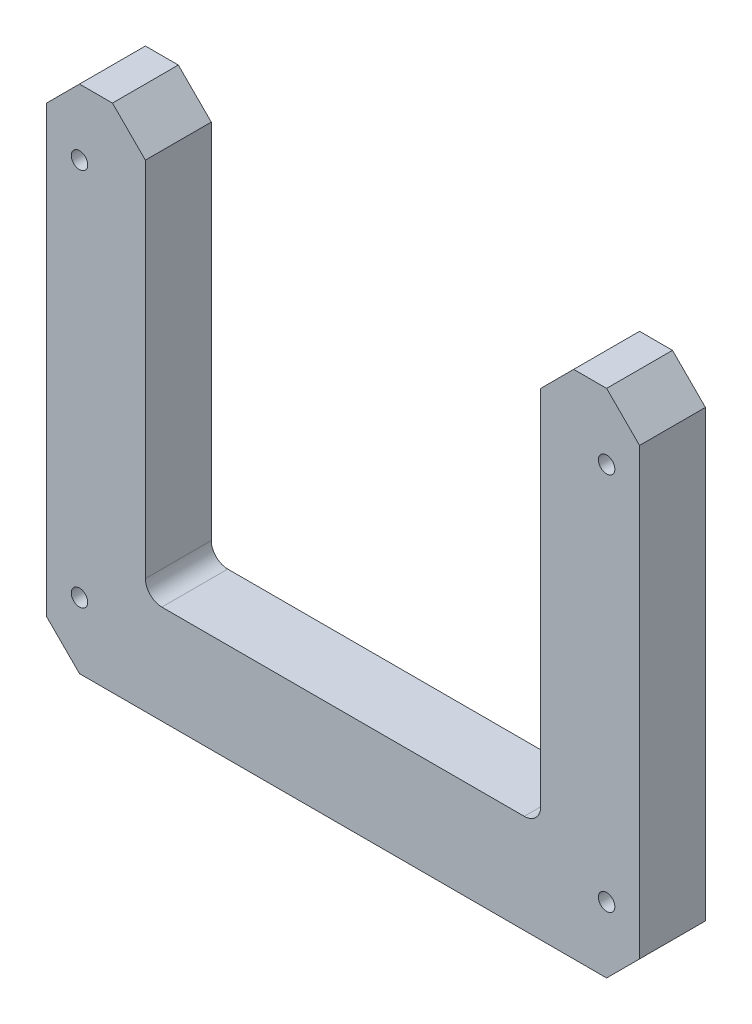
ISO-10303-21;
HEADER;
FILE_DESCRIPTION(('STEP AP214'),'2;1');
FILE_NAME('part.step','',(''),(''),'','','');
FILE_SCHEMA(('AUTOMOTIVE_DESIGN { 1 0 10303 214 1 1 1 1 }'));
ENDSEC;
DATA;
#1=APPLICATION_CONTEXT('core data for automotive mechanical design processes');
#2=APPLICATION_PROTOCOL_DEFINITION('international standard','automotive_design',2000,#1);
#3=PRODUCT_CONTEXT('',#1,'mechanical');
#4=PRODUCT('Part','Part','',(#3));
#5=PRODUCT_RELATED_PRODUCT_CATEGORY('part','',(#4));
#6=PRODUCT_DEFINITION_FORMATION('','',#4);
#7=PRODUCT_DEFINITION_CONTEXT('part definition',#1,'design');
#8=PRODUCT_DEFINITION('design','',#6,#7);
#9=PRODUCT_DEFINITION_SHAPE('','',#8);
#10=(LENGTH_UNIT() NAMED_UNIT(*) SI_UNIT(.MILLI.,.METRE.));
#11=(NAMED_UNIT(*) PLANE_ANGLE_UNIT() SI_UNIT($,.RADIAN.));
#12=(NAMED_UNIT(*) SI_UNIT($,.STERADIAN.) SOLID_ANGLE_UNIT());
#13=UNCERTAINTY_MEASURE_WITH_UNIT(LENGTH_MEASURE(1.E-05),#10,'distance_accuracy_value','');
#14=(GEOMETRIC_REPRESENTATION_CONTEXT(3) GLOBAL_UNCERTAINTY_ASSIGNED_CONTEXT((#13)) GLOBAL_UNIT_ASSIGNED_CONTEXT((#10,
#11,#12)) REPRESENTATION_CONTEXT('',''));
#15=CARTESIAN_POINT('',(0.,0.,0.));
#16=DIRECTION('',(0.,0.,1.));
#17=DIRECTION('',(1.,0.,0.));
#18=AXIS2_PLACEMENT_3D('',#15,#16,#17);
#19=CARTESIAN_POINT('',(-250.077465963196,69.0432096796373,12.7));
#20=DIRECTION('',(0.,-1.00000000000001,0.));
#21=DIRECTION('',(0.,0.,-1.00000000000001));
#22=AXIS2_PLACEMENT_3D('',#19,#20,#21);
#23=PLANE('',#22);
#24=DIRECTION('',(-1.,0.,0.));
#25=VECTOR('',#24,1.);
#26=CARTESIAN_POINT('',(-250.077465963196,69.043209679636,1.11022302462516E-13));
#27=LINE('',#26,#25);
#28=CARTESIAN_POINT('',(-237.377465963196,69.043209679636,0.));
#29=VERTEX_POINT('',#28);
#30=CARTESIAN_POINT('',(-243.727465963196,69.0432096796368,2.22044604925031E-13));
#31=VERTEX_POINT('',#30);
#32=EDGE_CURVE('E279',#29,#31,#27,.T.);
#33=ORIENTED_EDGE('',*,*,#32,.T.);
#34=DIRECTION('',(0.,0.,1.00000000000001));
#35=VECTOR('',#34,1.);
#36=CARTESIAN_POINT('',(-243.727465963196,69.0432096796373,12.7000000000001));
#37=LINE('',#36,#35);
#38=CARTESIAN_POINT('',(-243.727465963196,69.0432096796373,12.7000000000001));
#39=VERTEX_POINT('',#38);
#40=EDGE_CURVE('E51',#31,#39,#37,.T.);
#41=ORIENTED_EDGE('',*,*,#40,.T.);
#42=DIRECTION('',(-1.,0.,0.));
#43=VECTOR('',#42,1.);
#44=CARTESIAN_POINT('',(-250.077465963196,69.0432096796373,12.7));
#45=LINE('',#44,#43);
#46=CARTESIAN_POINT('',(-237.377465963196,69.0432096796372,12.7));
#47=VERTEX_POINT('',#46);
#48=EDGE_CURVE('E189',#47,#39,#45,.T.);
#49=ORIENTED_EDGE('',*,*,#48,.F.);
#50=DIRECTION('',(0.,0.,-1.00000000000001));
#51=VECTOR('',#50,1.);
#52=CARTESIAN_POINT('',(-237.377465963196,69.0432096796372,12.7));
#53=LINE('',#52,#51);
#54=EDGE_CURVE('E250',#47,#29,#53,.T.);
#55=ORIENTED_EDGE('',*,*,#54,.T.);
#56=EDGE_LOOP('',(#33,#41,#49,#55));
#57=FACE_BOUND('',#56,.T.);
#58=ADVANCED_FACE('F42',(#57),#23,.F.);
#59=CARTESIAN_POINT('',(-250.077465963196,69.0432096796373,12.7));
#60=DIRECTION('',(1.,0.,0.));
#61=DIRECTION('',(0.,0.,-1.00000000000001));
#62=AXIS2_PLACEMENT_3D('',#59,#60,#61);
#63=PLANE('',#62);
#64=DIRECTION('',(0.,-1.00000000000001,0.));
#65=VECTOR('',#64,1.);
#66=CARTESIAN_POINT('',(-250.077465963196,69.043209679636,1.11022302462516E-13));
#67=LINE('',#66,#65);
#68=CARTESIAN_POINT('',(-250.077465963196,62.6932096796363,0.));
#69=VERTEX_POINT('',#68);
#70=CARTESIAN_POINT('',(-250.077465963196,-23.031790320364,1.11022302462516E-13));
#71=VERTEX_POINT('',#70);
#72=EDGE_CURVE('E299',#69,#71,#67,.T.);
#73=ORIENTED_EDGE('',*,*,#72,.T.);
#74=DIRECTION('',(0.,0.,1.00000000000001));
#75=VECTOR('',#74,1.);
#76=CARTESIAN_POINT('',(-250.077465963196,-23.0317903203641,12.7000000000001));
#77=LINE('',#76,#75);
#78=CARTESIAN_POINT('',(-250.077465963196,-23.0317903203641,12.7000000000001));
#79=VERTEX_POINT('',#78);
#80=EDGE_CURVE('E224',#71,#79,#77,.T.);
#81=ORIENTED_EDGE('',*,*,#80,.T.);
#82=DIRECTION('',(0.,-1.00000000000001,0.));
#83=VECTOR('',#82,1.);
#84=CARTESIAN_POINT('',(-250.077465963196,69.0432096796373,12.7));
#85=LINE('',#84,#83);
#86=CARTESIAN_POINT('',(-250.077465963196,62.693209679637,12.7000000000003));
#87=VERTEX_POINT('',#86);
#88=EDGE_CURVE('E282',#87,#79,#85,.T.);
#89=ORIENTED_EDGE('',*,*,#88,.F.);
#90=DIRECTION('',(0.,0.,-1.00000000000001));
#91=VECTOR('',#90,1.);
#92=CARTESIAN_POINT('',(-250.077465963196,62.693209679637,12.7000000000003));
#93=LINE('',#92,#91);
#94=EDGE_CURVE('E221',#87,#69,#93,.T.);
#95=ORIENTED_EDGE('',*,*,#94,.T.);
#96=EDGE_LOOP('',(#73,#81,#89,#95));
#97=FACE_BOUND('',#96,.T.);
#98=ADVANCED_FACE('F339',(#97),#63,.F.);
#99=CARTESIAN_POINT('',(-250.077465963195,-29.381790320364,12.7));
#100=DIRECTION('',(0.,1.00000000000001,0.));
#101=DIRECTION('',(-1.,0.,0.));
#102=AXIS2_PLACEMENT_3D('',#99,#100,#101);
#103=PLANE('',#102);
#104=DIRECTION('',(1.,0.,0.));
#105=VECTOR('',#104,1.);
#106=CARTESIAN_POINT('',(-250.077465963195,-29.381790320364,12.7));
#107=LINE('',#106,#105);
#108=CARTESIAN_POINT('',(-243.727465963196,-29.381790320364,12.7000000000001));
#109=VERTEX_POINT('',#108);
#110=CARTESIAN_POINT('',(-142.127465963196,-29.3817903203637,12.7));
#111=VERTEX_POINT('',#110);
#112=EDGE_CURVE('E285',#109,#111,#107,.T.);
#113=ORIENTED_EDGE('',*,*,#112,.F.);
#114=DIRECTION('',(0.,0.,-1.00000000000001));
#115=VECTOR('',#114,1.);
#116=CARTESIAN_POINT('',(-243.727465963196,-29.381790320364,12.7000000000001));
#117=LINE('',#116,#115);
#118=CARTESIAN_POINT('',(-243.727465963196,-29.3817903203636,1.11022302462516E-13));
#119=VERTEX_POINT('',#118);
#120=EDGE_CURVE('E206',#109,#119,#117,.T.);
#121=ORIENTED_EDGE('',*,*,#120,.T.);
#122=DIRECTION('',(1.,0.,0.));
#123=VECTOR('',#122,1.);
#124=CARTESIAN_POINT('',(-250.077465963196,-29.3817903203637,1.11022302462516E-13));
#125=LINE('',#124,#123);
#126=CARTESIAN_POINT('',(-142.127465963196,-29.3817903203638,0.));
#127=VERTEX_POINT('',#126);
#128=EDGE_CURVE('E302',#119,#127,#125,.T.);
#129=ORIENTED_EDGE('',*,*,#128,.T.);
#130=DIRECTION('',(0.,0.,1.00000000000001));
#131=VECTOR('',#130,1.);
#132=CARTESIAN_POINT('',(-142.127465963196,-29.3817903203637,12.7));
#133=LINE('',#132,#131);
#134=EDGE_CURVE('E204',#127,#111,#133,.T.);
#135=ORIENTED_EDGE('',*,*,#134,.T.);
#136=EDGE_LOOP('',(#113,#121,#129,#135));
#137=FACE_BOUND('',#136,.T.);
#138=ADVANCED_FACE('F347',(#137),#103,.F.);
#139=CARTESIAN_POINT('',(-135.777465963196,69.0432096796371,12.7));
#140=DIRECTION('',(-1.,0.,0.));
#141=DIRECTION('',(0.,0.,1.00000000000001));
#142=AXIS2_PLACEMENT_3D('',#139,#140,#141);
#143=PLANE('',#142);
#144=DIRECTION('',(0.,1.00000000000001,0.));
#145=VECTOR('',#144,1.);
#146=CARTESIAN_POINT('',(-135.777465963196,69.0432096796371,12.7));
#147=LINE('',#146,#145);
#148=CARTESIAN_POINT('',(-135.777465963196,-23.031790320364,12.7000000000002));
#149=VERTEX_POINT('',#148);
#150=CARTESIAN_POINT('',(-135.777465963196,62.6932096796371,12.7));
#151=VERTEX_POINT('',#150);
#152=EDGE_CURVE('E288',#149,#151,#147,.T.);
#153=ORIENTED_EDGE('',*,*,#152,.F.);
#154=DIRECTION('',(0.,0.,-1.00000000000001));
#155=VECTOR('',#154,1.);
#156=CARTESIAN_POINT('',(-135.777465963196,-23.031790320364,12.7000000000002));
#157=LINE('',#156,#155);
#158=CARTESIAN_POINT('',(-135.777465963196,-23.0317903203639,0.));
#159=VERTEX_POINT('',#158);
#160=EDGE_CURVE('E239',#149,#159,#157,.T.);
#161=ORIENTED_EDGE('',*,*,#160,.T.);
#162=DIRECTION('',(0.,1.00000000000001,0.));
#163=VECTOR('',#162,1.);
#164=CARTESIAN_POINT('',(-135.777465963196,69.0432096796361,0.));
#165=LINE('',#164,#163);
#166=CARTESIAN_POINT('',(-135.777465963196,62.693209679636,1.11022302462516E-13));
#167=VERTEX_POINT('',#166);
#168=EDGE_CURVE('E305',#159,#167,#165,.T.);
#169=ORIENTED_EDGE('',*,*,#168,.T.);
#170=DIRECTION('',(0.,0.,1.00000000000001));
#171=VECTOR('',#170,1.);
#172=CARTESIAN_POINT('',(-135.777465963196,62.6932096796371,12.7));
#173=LINE('',#172,#171);
#174=EDGE_CURVE('E237',#167,#151,#173,.T.);
#175=ORIENTED_EDGE('',*,*,#174,.T.);
#176=EDGE_LOOP('',(#153,#161,#169,#175));
#177=FACE_BOUND('',#176,.T.);
#178=ADVANCED_FACE('F356',(#177),#143,.F.);
#179=CARTESIAN_POINT('',(-154.827465963196,69.0432096796377,12.7000000000003));
#180=DIRECTION('',(0.,-1.00000000000001,0.));
#181=DIRECTION('',(0.,0.,-1.00000000000001));
#182=AXIS2_PLACEMENT_3D('',#179,#180,#181);
#183=PLANE('',#182);
#184=DIRECTION('',(-1.,0.,0.));
#185=VECTOR('',#184,1.);
#186=CARTESIAN_POINT('',(-154.827465963196,69.0432096796377,12.7000000000003));
#187=LINE('',#186,#185);
#188=CARTESIAN_POINT('',(-142.127465963196,69.0432096796372,12.7));
#189=VERTEX_POINT('',#188);
#190=CARTESIAN_POINT('',(-148.477465963196,69.0432096796377,12.7000000000005));
#191=VERTEX_POINT('',#190);
#192=EDGE_CURVE('E291',#189,#191,#187,.T.);
#193=ORIENTED_EDGE('',*,*,#192,.F.);
#194=DIRECTION('',(0.,0.,-1.00000000000001));
#195=VECTOR('',#194,1.);
#196=CARTESIAN_POINT('',(-142.127465963196,69.0432096796372,12.7));
#197=LINE('',#196,#195);
#198=CARTESIAN_POINT('',(-142.127465963196,69.0432096796361,0.));
#199=VERTEX_POINT('',#198);
#200=EDGE_CURVE('E244',#189,#199,#197,.T.);
#201=ORIENTED_EDGE('',*,*,#200,.T.);
#202=DIRECTION('',(-1.,0.,0.));
#203=VECTOR('',#202,1.);
#204=CARTESIAN_POINT('',(-154.827465963196,69.043209679636,0.));
#205=LINE('',#204,#203);
#206=CARTESIAN_POINT('',(-148.477465963196,69.0432096796366,7.7715611723761E-13));
#207=VERTEX_POINT('',#206);
#208=EDGE_CURVE('E191',#199,#207,#205,.T.);
#209=ORIENTED_EDGE('',*,*,#208,.T.);
#210=DIRECTION('',(0.,0.,1.00000000000001));
#211=VECTOR('',#210,1.);
#212=CARTESIAN_POINT('',(-148.477465963196,69.0432096796377,12.7000000000005));
#213=LINE('',#212,#211);
#214=EDGE_CURVE('E242',#207,#191,#213,.T.);
#215=ORIENTED_EDGE('',*,*,#214,.T.);
#216=EDGE_LOOP('',(#193,#201,#209,#215));
#217=FACE_BOUND('',#216,.T.);
#218=ADVANCED_FACE('F312',(#217),#183,.F.);
#219=CARTESIAN_POINT('',(-154.827465963196,69.0432096796377,12.7000000000003));
#220=DIRECTION('',(1.,0.,0.));
#221=DIRECTION('',(0.,0.,-1.00000000000001));
#222=AXIS2_PLACEMENT_3D('',#219,#220,#221);
#223=PLANE('',#222);
#224=DIRECTION('',(0.,-1.00000000000001,0.));
#225=VECTOR('',#224,1.);
#226=CARTESIAN_POINT('',(-154.827465963196,69.0432096796377,12.7000000000003));
#227=LINE('',#226,#225);
#228=CARTESIAN_POINT('',(-154.827465963196,62.6932096796371,12.7000000000002));
#229=VERTEX_POINT('',#228);
#230=CARTESIAN_POINT('',(-154.827465963196,-7.15679032036326,12.7000000000008));
#231=VERTEX_POINT('',#230);
#232=EDGE_CURVE('E293',#229,#231,#227,.T.);
#233=ORIENTED_EDGE('',*,*,#232,.F.);
#234=DIRECTION('',(0.,0.,-1.00000000000001));
#235=VECTOR('',#234,1.);
#236=CARTESIAN_POINT('',(-154.827465963196,62.6932096796371,12.7000000000002));
#237=LINE('',#236,#235);
#238=CARTESIAN_POINT('',(-154.827465963196,62.693209679637,4.9960036108132E-13));
#239=VERTEX_POINT('',#238);
#240=EDGE_CURVE('E247',#229,#239,#237,.T.);
#241=ORIENTED_EDGE('',*,*,#240,.T.);
#242=DIRECTION('',(0.,-1.00000000000001,0.));
#243=VECTOR('',#242,1.);
#244=CARTESIAN_POINT('',(-154.827465963196,69.043209679636,0.));
#245=LINE('',#244,#243);
#246=CARTESIAN_POINT('',(-154.827465963196,-7.15679032036395,1.11022302462516E-13));
#247=VERTEX_POINT('',#246);
#248=EDGE_CURVE('E187',#239,#247,#245,.T.);
#249=ORIENTED_EDGE('',*,*,#248,.T.);
#250=DIRECTION('',(0.,0.,-1.00000000000001));
#251=VECTOR('',#250,1.);
#252=CARTESIAN_POINT('',(-154.827465963196,-7.15679032036326,12.7000000000008));
#253=LINE('',#252,#251);
#254=EDGE_CURVE('E165',#247,#231,#253,.F.);
#255=ORIENTED_EDGE('',*,*,#254,.T.);
#256=EDGE_LOOP('',(#233,#241,#249,#255));
#257=FACE_BOUND('',#256,.T.);
#258=ADVANCED_FACE('F318',(#257),#223,.F.);
#259=CARTESIAN_POINT('',(-231.027465963196,-10.331790320363,12.7000000000007));
#260=DIRECTION('',(0.,-1.00000000000001,0.));
#261=DIRECTION('',(1.,0.,0.));
#262=AXIS2_PLACEMENT_3D('',#259,#260,#261);
#263=PLANE('',#262);
#264=DIRECTION('',(-1.,0.,0.));
#265=VECTOR('',#264,1.);
#266=CARTESIAN_POINT('',(-231.027465963196,-10.331790320363,12.7000000000007));
#267=LINE('',#266,#265);
#268=CARTESIAN_POINT('',(-158.002465963196,-10.3317903203632,12.7000000000005));
#269=VERTEX_POINT('',#268);
#270=CARTESIAN_POINT('',(-227.852465963196,-10.3317903203636,12.7000000000002));
#271=VERTEX_POINT('',#270);
#272=EDGE_CURVE('E179',#269,#271,#267,.T.);
#273=ORIENTED_EDGE('',*,*,#272,.F.);
#274=DIRECTION('',(0.,0.,-1.00000000000001));
#275=VECTOR('',#274,1.);
#276=CARTESIAN_POINT('',(-158.002465963196,-10.3317903203639,0.));
#277=LINE('',#276,#275);
#278=CARTESIAN_POINT('',(-158.002465963196,-10.3317903203639,0.));
#279=VERTEX_POINT('',#278);
#280=EDGE_CURVE('E163',#269,#279,#277,.T.);
#281=ORIENTED_EDGE('',*,*,#280,.T.);
#282=DIRECTION('',(-1.,0.,0.));
#283=VECTOR('',#282,1.);
#284=CARTESIAN_POINT('',(-231.027465963196,-10.331790320364,1.11022302462516E-13));
#285=LINE('',#284,#283);
#286=CARTESIAN_POINT('',(-227.852465963196,-10.3317903203639,0.));
#287=VERTEX_POINT('',#286);
#288=EDGE_CURVE('E176',#279,#287,#285,.T.);
#289=ORIENTED_EDGE('',*,*,#288,.T.);
#290=DIRECTION('',(0.,0.,-1.00000000000001));
#291=VECTOR('',#290,1.);
#292=CARTESIAN_POINT('',(-227.852465963196,-10.3317903203636,12.7000000000002));
#293=LINE('',#292,#291);
#294=EDGE_CURVE('E180',#287,#271,#293,.F.);
#295=ORIENTED_EDGE('',*,*,#294,.T.);
#296=EDGE_LOOP('',(#273,#281,#289,#295));
#297=FACE_BOUND('',#296,.T.);
#298=ADVANCED_FACE('F175',(#297),#263,.F.);
#299=CARTESIAN_POINT('',(-231.027465963196,69.043209679637,12.7000000000002));
#300=DIRECTION('',(-1.,0.,0.));
#301=DIRECTION('',(0.,0.,1.00000000000001));
#302=AXIS2_PLACEMENT_3D('',#299,#300,#301);
#303=PLANE('',#302);
#304=DIRECTION('',(0.,1.00000000000001,0.));
#305=VECTOR('',#304,1.);
#306=CARTESIAN_POINT('',(-231.027465963196,69.0432096796361,2.22044604925031E-13));
#307=LINE('',#306,#305);
#308=CARTESIAN_POINT('',(-231.027465963196,-7.15679032036401,0.));
#309=VERTEX_POINT('',#308);
#310=CARTESIAN_POINT('',(-231.027465963196,62.6932096796361,1.11022302462516E-13));
#311=VERTEX_POINT('',#310);
#312=EDGE_CURVE('E186',#309,#311,#307,.T.);
#313=ORIENTED_EDGE('',*,*,#312,.T.);
#314=DIRECTION('',(0.,0.,1.00000000000001));
#315=VECTOR('',#314,1.);
#316=CARTESIAN_POINT('',(-231.027465963196,62.6932096796371,12.7000000000002));
#317=LINE('',#316,#315);
#318=CARTESIAN_POINT('',(-231.027465963196,62.6932096796371,12.7000000000002));
#319=VERTEX_POINT('',#318);
#320=EDGE_CURVE('E11',#311,#319,#317,.T.);
#321=ORIENTED_EDGE('',*,*,#320,.T.);
#322=DIRECTION('',(0.,1.00000000000001,0.));
#323=VECTOR('',#322,1.);
#324=CARTESIAN_POINT('',(-231.027465963196,69.043209679637,12.7000000000002));
#325=LINE('',#324,#323);
#326=CARTESIAN_POINT('',(-231.027465963196,-7.15679032036345,12.7000000000003));
#327=VERTEX_POINT('',#326);
#328=EDGE_CURVE('E195',#327,#319,#325,.T.);
#329=ORIENTED_EDGE('',*,*,#328,.F.);
#330=DIRECTION('',(0.,0.,-1.00000000000001));
#331=VECTOR('',#330,1.);
#332=CARTESIAN_POINT('',(-231.027465963196,-7.15679032036401,0.));
#333=LINE('',#332,#331);
#334=EDGE_CURVE('E170',#327,#309,#333,.T.);
#335=ORIENTED_EDGE('',*,*,#334,.T.);
#336=EDGE_LOOP('',(#313,#321,#329,#335));
#337=FACE_BOUND('',#336,.T.);
#338=ADVANCED_FACE('F324',(#337),#303,.F.);
#339=CARTESIAN_POINT('',(0.,6.10622663543836E-13,12.7000000000004));
#340=DIRECTION('',(0.,0.,-1.00000000000001));
#341=DIRECTION('',(-1.,0.,0.));
#342=AXIS2_PLACEMENT_3D('',#339,#340,#341);
#343=PLANE('',#342);
#344=CARTESIAN_POINT('',(-243.727465963196,-16.6817903203637,12.7));
#345=DIRECTION('',(0.,0.,-1.00000000000001));
#346=DIRECTION('',(-1.,0.,0.));
#347=AXIS2_PLACEMENT_3D('',#344,#345,#346);
#348=CIRCLE('',#347,1.58749999999999);
#349=CARTESIAN_POINT('',(-245.314965963196,-16.6817903203637,12.7));
#350=VERTEX_POINT('',#349);
#351=EDGE_CURVE('E264',#350,#350,#348,.T.);
#352=ORIENTED_EDGE('',*,*,#351,.T.);
#353=EDGE_LOOP('',(#352));
#354=FACE_BOUND('',#353,.T.);
#355=CARTESIAN_POINT('',(-243.727465963196,56.3432096796373,12.7000000000001));
#356=DIRECTION('',(0.,0.,-1.00000000000001));
#357=DIRECTION('',(-1.,0.,0.));
#358=AXIS2_PLACEMENT_3D('',#355,#356,#357);
#359=CIRCLE('',#358,1.58749999999999);
#360=CARTESIAN_POINT('',(-245.314965963196,56.3432096796373,12.7000000000001));
#361=VERTEX_POINT('',#360);
#362=EDGE_CURVE('E261',#361,#361,#359,.T.);
#363=ORIENTED_EDGE('',*,*,#362,.T.);
#364=EDGE_LOOP('',(#363));
#365=FACE_BOUND('',#364,.T.);
#366=CARTESIAN_POINT('',(-142.127465963196,-16.6817903203637,12.7));
#367=DIRECTION('',(0.,0.,-1.00000000000001));
#368=DIRECTION('',(-1.,0.,0.));
#369=AXIS2_PLACEMENT_3D('',#366,#367,#368);
#370=CIRCLE('',#369,1.58749999999999);
#371=CARTESIAN_POINT('',(-143.714965963196,-16.6817903203637,12.7));
#372=VERTEX_POINT('',#371);
#373=EDGE_CURVE('E258',#372,#372,#370,.T.);
#374=ORIENTED_EDGE('',*,*,#373,.T.);
#375=EDGE_LOOP('',(#374));
#376=FACE_BOUND('',#375,.T.);
#377=CARTESIAN_POINT('',(-142.127465963196,56.3432096796373,12.7));
#378=DIRECTION('',(0.,0.,-1.00000000000001));
#379=DIRECTION('',(-1.,0.,0.));
#380=AXIS2_PLACEMENT_3D('',#377,#378,#379);
#381=CIRCLE('',#380,1.58749999999999);
#382=CARTESIAN_POINT('',(-143.714965963196,56.3432096796373,12.7));
#383=VERTEX_POINT('',#382);
#384=EDGE_CURVE('E257',#383,#383,#381,.T.);
#385=ORIENTED_EDGE('',*,*,#384,.T.);
#386=EDGE_LOOP('',(#385));
#387=FACE_BOUND('',#386,.T.);
#388=ORIENTED_EDGE('',*,*,#88,.T.);
#389=DIRECTION('',(-0.707106781186549,0.707106781186551,0.));
#390=VECTOR('',#389,1.);
#391=CARTESIAN_POINT('',(-243.727465963196,-29.381790320364,12.7000000000001));
#392=LINE('',#391,#390);
#393=EDGE_CURVE('E235',#79,#109,#392,.F.);
#394=ORIENTED_EDGE('',*,*,#393,.T.);
#395=ORIENTED_EDGE('',*,*,#112,.T.);
#396=DIRECTION('',(-0.707106781186548,-0.707106781186557,0.));
#397=VECTOR('',#396,1.);
#398=CARTESIAN_POINT('',(-135.777465963196,-23.031790320364,12.7000000000002));
#399=LINE('',#398,#397);
#400=EDGE_CURVE('E233',#111,#149,#399,.F.);
#401=ORIENTED_EDGE('',*,*,#400,.T.);
#402=ORIENTED_EDGE('',*,*,#152,.T.);
#403=DIRECTION('',(0.707106781186544,-0.707106781186556,0.));
#404=VECTOR('',#403,1.);
#405=CARTESIAN_POINT('',(-142.127465963196,69.0432096796372,12.7));
#406=LINE('',#405,#404);
#407=EDGE_CURVE('E231',#151,#189,#406,.F.);
#408=ORIENTED_EDGE('',*,*,#407,.T.);
#409=ORIENTED_EDGE('',*,*,#192,.T.);
#410=DIRECTION('',(0.707106781186551,0.707106781186554,0.));
#411=VECTOR('',#410,1.);
#412=CARTESIAN_POINT('',(-154.827465963196,62.6932096796371,12.7000000000002));
#413=LINE('',#412,#411);
#414=EDGE_CURVE('E65',#191,#229,#413,.F.);
#415=ORIENTED_EDGE('',*,*,#414,.T.);
#416=ORIENTED_EDGE('',*,*,#232,.T.);
#417=CARTESIAN_POINT('',(-158.002465963196,-7.15679032036323,12.7000000000007));
#418=DIRECTION('',(0.,0.,-1.00000000000001));
#419=DIRECTION('',(-1.,0.,0.));
#420=AXIS2_PLACEMENT_3D('',#417,#418,#419);
#421=CIRCLE('',#420,3.175);
#422=EDGE_CURVE('E169',#231,#269,#421,.T.);
#423=ORIENTED_EDGE('',*,*,#422,.T.);
#424=ORIENTED_EDGE('',*,*,#272,.T.);
#425=CARTESIAN_POINT('',(-227.852465963196,-7.1567903203632,12.7000000000008));
#426=DIRECTION('',(0.,0.,-1.00000000000001));
#427=DIRECTION('',(-1.,0.,0.));
#428=AXIS2_PLACEMENT_3D('',#425,#426,#427);
#429=CIRCLE('',#428,3.175);
#430=EDGE_CURVE('E202',#271,#327,#429,.T.);
#431=ORIENTED_EDGE('',*,*,#430,.T.);
#432=ORIENTED_EDGE('',*,*,#328,.T.);
#433=DIRECTION('',(0.707106781186546,-0.707106781186554,0.));
#434=VECTOR('',#433,1.);
#435=CARTESIAN_POINT('',(-237.377465963196,69.0432096796372,12.7));
#436=LINE('',#435,#434);
#437=EDGE_CURVE('E226',#319,#47,#436,.F.);
#438=ORIENTED_EDGE('',*,*,#437,.T.);
#439=ORIENTED_EDGE('',*,*,#48,.T.);
#440=DIRECTION('',(0.70710678118655,0.707106781186555,0.));
#441=VECTOR('',#440,1.);
#442=CARTESIAN_POINT('',(-250.077465963196,62.693209679637,12.7000000000003));
#443=LINE('',#442,#441);
#444=EDGE_CURVE('E228',#39,#87,#443,.F.);
#445=ORIENTED_EDGE('',*,*,#444,.T.);
#446=EDGE_LOOP('',(#388,#394,#395,#401,#402,#408,#409,#415,#416,#423,#424,#431,#432,#438,#439,#445));
#447=FACE_BOUND('',#446,.T.);
#448=ADVANCED_FACE('F319',(#354,#365,#376,#387,#447),#343,.F.);
#449=CARTESIAN_POINT('',(0.,0.,0.));
#450=DIRECTION('',(0.,0.,-1.00000000000001));
#451=DIRECTION('',(-1.,0.,0.));
#452=AXIS2_PLACEMENT_3D('',#449,#450,#451);
#453=PLANE('',#452);
#454=CARTESIAN_POINT('',(-243.727465963196,-16.6817903203635,1.11022302462516E-13));
#455=DIRECTION('',(0.,0.,-1.00000000000001));
#456=DIRECTION('',(-1.,0.,0.));
#457=AXIS2_PLACEMENT_3D('',#454,#455,#456);
#458=CIRCLE('',#457,1.58749999999999);
#459=CARTESIAN_POINT('',(-245.314965963196,-16.6817903203635,1.11198550367675E-13));
#460=VERTEX_POINT('',#459);
#461=EDGE_CURVE('E46',#460,#460,#458,.T.);
#462=ORIENTED_EDGE('',*,*,#461,.F.);
#463=EDGE_LOOP('',(#462));
#464=FACE_BOUND('',#463,.T.);
#465=CARTESIAN_POINT('',(-243.727465963196,56.3432096796363,1.66533453693773E-13));
#466=DIRECTION('',(0.,0.,-1.00000000000001));
#467=DIRECTION('',(-1.,0.,0.));
#468=AXIS2_PLACEMENT_3D('',#465,#466,#467);
#469=CIRCLE('',#468,1.58749999999999);
#470=CARTESIAN_POINT('',(-245.314965963196,56.3432096796363,1.66709701598933E-13));
#471=VERTEX_POINT('',#470);
#472=EDGE_CURVE('E262',#471,#471,#469,.T.);
#473=ORIENTED_EDGE('',*,*,#472,.F.);
#474=EDGE_LOOP('',(#473));
#475=FACE_BOUND('',#474,.T.);
#476=CARTESIAN_POINT('',(-142.127465963196,-16.681790320364,1.11022302462516E-13));
#477=DIRECTION('',(0.,0.,-1.00000000000001));
#478=DIRECTION('',(-1.,0.,0.));
#479=AXIS2_PLACEMENT_3D('',#476,#477,#478);
#480=CIRCLE('',#479,1.58749999999999);
#481=CARTESIAN_POINT('',(-143.714965963196,-16.681790320364,1.11198550367675E-13));
#482=VERTEX_POINT('',#481);
#483=EDGE_CURVE('E259',#482,#482,#480,.T.);
#484=ORIENTED_EDGE('',*,*,#483,.F.);
#485=EDGE_LOOP('',(#484));
#486=FACE_BOUND('',#485,.T.);
#487=CARTESIAN_POINT('',(-142.127465963196,56.3432096796361,1.66533453693773E-13));
#488=DIRECTION('',(0.,0.,-1.00000000000001));
#489=DIRECTION('',(-1.,0.,0.));
#490=AXIS2_PLACEMENT_3D('',#487,#488,#489);
#491=CIRCLE('',#490,1.58749999999999);
#492=CARTESIAN_POINT('',(-143.714965963196,56.3432096796361,1.66709701598933E-13));
#493=VERTEX_POINT('',#492);
#494=EDGE_CURVE('E254',#493,#493,#491,.T.);
#495=ORIENTED_EDGE('',*,*,#494,.F.);
#496=EDGE_LOOP('',(#495));
#497=FACE_BOUND('',#496,.T.);
#498=ORIENTED_EDGE('',*,*,#128,.F.);
#499=DIRECTION('',(0.707106781186549,-0.707106781186551,0.));
#500=VECTOR('',#499,1.);
#501=CARTESIAN_POINT('',(-136.55462814178,-136.554628141782,-1.66533453693773E-13));
#502=LINE('',#501,#500);
#503=EDGE_CURVE('E219',#119,#71,#502,.F.);
#504=ORIENTED_EDGE('',*,*,#503,.T.);
#505=ORIENTED_EDGE('',*,*,#72,.F.);
#506=DIRECTION('',(-0.70710678118655,-0.707106781186555,0.));
#507=VECTOR('',#506,1.);
#508=CARTESIAN_POINT('',(-156.385337821415,156.385337821418,7.21644966006352E-13));
#509=LINE('',#508,#507);
#510=EDGE_CURVE('E211',#69,#31,#509,.F.);
#511=ORIENTED_EDGE('',*,*,#510,.T.);
#512=ORIENTED_EDGE('',*,*,#32,.F.);
#513=DIRECTION('',(-0.707106781186546,0.707106781186554,0.));
#514=VECTOR('',#513,1.);
#515=CARTESIAN_POINT('',(-84.1671281417806,-84.1671281417809,-7.21644966006352E-13));
#516=LINE('',#515,#514);
#517=EDGE_CURVE('E209',#29,#311,#516,.F.);
#518=ORIENTED_EDGE('',*,*,#517,.T.);
#519=ORIENTED_EDGE('',*,*,#312,.F.);
#520=CARTESIAN_POINT('',(-227.852465963196,-7.15679032036398,2.22044604925031E-13));
#521=DIRECTION('',(0.,0.,-1.00000000000001));
#522=DIRECTION('',(-1.,0.,0.));
#523=AXIS2_PLACEMENT_3D('',#520,#521,#522);
#524=CIRCLE('',#523,3.175);
#525=EDGE_CURVE('E185',#309,#287,#524,.F.);
#526=ORIENTED_EDGE('',*,*,#525,.T.);
#527=ORIENTED_EDGE('',*,*,#288,.F.);
#528=CARTESIAN_POINT('',(-158.002465963196,-7.15679032036404,1.11022302462516E-13));
#529=DIRECTION('',(0.,0.,-1.00000000000001));
#530=DIRECTION('',(-1.,0.,0.));
#531=AXIS2_PLACEMENT_3D('',#528,#529,#530);
#532=CIRCLE('',#531,3.175);
#533=EDGE_CURVE('E159',#279,#247,#532,.F.);
#534=ORIENTED_EDGE('',*,*,#533,.T.);
#535=ORIENTED_EDGE('',*,*,#248,.F.);
#536=DIRECTION('',(-0.707106781186551,-0.707106781186554,0.));
#537=VECTOR('',#536,1.);
#538=CARTESIAN_POINT('',(-108.760337821416,108.760337821418,1.16573417585641E-12));
#539=LINE('',#538,#537);
#540=EDGE_CURVE('E213',#239,#207,#539,.F.);
#541=ORIENTED_EDGE('',*,*,#540,.T.);
#542=ORIENTED_EDGE('',*,*,#208,.F.);
#543=DIRECTION('',(-0.707106781186544,0.707106781186556,0.));
#544=VECTOR('',#543,1.);
#545=CARTESIAN_POINT('',(-36.5421281417807,-36.5421281417804,0.));
#546=LINE('',#545,#544);
#547=EDGE_CURVE('E215',#199,#167,#546,.F.);
#548=ORIENTED_EDGE('',*,*,#547,.T.);
#549=ORIENTED_EDGE('',*,*,#168,.F.);
#550=DIRECTION('',(0.707106781186548,0.707106781186557,0.));
#551=VECTOR('',#550,1.);
#552=CARTESIAN_POINT('',(-56.3728378214162,56.372837821417,1.11022302462516E-13));
#553=LINE('',#552,#551);
#554=EDGE_CURVE('E217',#159,#127,#553,.F.);
#555=ORIENTED_EDGE('',*,*,#554,.T.);
#556=EDGE_LOOP('',(#498,#504,#505,#511,#512,#518,#519,#526,#527,#534,#535,#541,#542,#548,#549,#555));
#557=FACE_BOUND('',#556,.T.);
#558=ADVANCED_FACE('F183',(#464,#475,#486,#497,#557),#453,.T.);
#559=CARTESIAN_POINT('',(-158.002465963196,-7.15679032036323,12.7000000000007));
#560=DIRECTION('',(0.,0.,1.00000000000001));
#561=DIRECTION('',(1.,0.,0.));
#562=AXIS2_PLACEMENT_3D('',#559,#560,#561);
#563=CYLINDRICAL_SURFACE('',#562,3.175);
#564=ORIENTED_EDGE('',*,*,#422,.F.);
#565=ORIENTED_EDGE('',*,*,#254,.F.);
#566=ORIENTED_EDGE('',*,*,#533,.F.);
#567=ORIENTED_EDGE('',*,*,#280,.F.);
#568=EDGE_LOOP('',(#564,#565,#566,#567));
#569=FACE_BOUND('',#568,.T.);
#570=ADVANCED_FACE('F162',(#569),#563,.F.);
#571=CARTESIAN_POINT('',(-227.852465963196,-7.1567903203632,12.7000000000008));
#572=DIRECTION('',(0.,0.,1.00000000000001));
#573=DIRECTION('',(1.,0.,0.));
#574=AXIS2_PLACEMENT_3D('',#571,#572,#573);
#575=CYLINDRICAL_SURFACE('',#574,3.175);
#576=ORIENTED_EDGE('',*,*,#430,.F.);
#577=ORIENTED_EDGE('',*,*,#294,.F.);
#578=ORIENTED_EDGE('',*,*,#525,.F.);
#579=ORIENTED_EDGE('',*,*,#334,.F.);
#580=EDGE_LOOP('',(#576,#577,#578,#579));
#581=FACE_BOUND('',#580,.T.);
#582=ADVANCED_FACE('F323',(#581),#575,.F.);
#583=CARTESIAN_POINT('',(-243.727465963196,-29.381790320364,12.7000000000001));
#584=DIRECTION('',(0.707106781186546,0.707106781186559,0.));
#585=DIRECTION('',(0.,0.,-1.00000000000001));
#586=AXIS2_PLACEMENT_3D('',#583,#584,#585);
#587=PLANE('',#586);
#588=ORIENTED_EDGE('',*,*,#393,.F.);
#589=ORIENTED_EDGE('',*,*,#80,.F.);
#590=ORIENTED_EDGE('',*,*,#503,.F.);
#591=ORIENTED_EDGE('',*,*,#120,.F.);
#592=EDGE_LOOP('',(#588,#589,#590,#591));
#593=FACE_BOUND('',#592,.T.);
#594=ADVANCED_FACE('F344',(#593),#587,.F.);
#595=CARTESIAN_POINT('',(-135.777465963196,-23.031790320364,12.7000000000002));
#596=DIRECTION('',(-0.707106781186547,0.707106781186553,0.));
#597=DIRECTION('',(0.,0.,-1.00000000000001));
#598=AXIS2_PLACEMENT_3D('',#595,#596,#597);
#599=PLANE('',#598);
#600=ORIENTED_EDGE('',*,*,#400,.F.);
#601=ORIENTED_EDGE('',*,*,#134,.F.);
#602=ORIENTED_EDGE('',*,*,#554,.F.);
#603=ORIENTED_EDGE('',*,*,#160,.F.);
#604=EDGE_LOOP('',(#600,#601,#602,#603));
#605=FACE_BOUND('',#604,.T.);
#606=ADVANCED_FACE('F353',(#605),#599,.F.);
#607=CARTESIAN_POINT('',(-142.127465963196,69.0432096796372,12.7));
#608=DIRECTION('',(-0.707106781186551,-0.707106781186554,0.));
#609=DIRECTION('',(0.,0.,-1.00000000000001));
#610=AXIS2_PLACEMENT_3D('',#607,#608,#609);
#611=PLANE('',#610);
#612=ORIENTED_EDGE('',*,*,#407,.F.);
#613=ORIENTED_EDGE('',*,*,#174,.F.);
#614=ORIENTED_EDGE('',*,*,#547,.F.);
#615=ORIENTED_EDGE('',*,*,#200,.F.);
#616=EDGE_LOOP('',(#612,#613,#614,#615));
#617=FACE_BOUND('',#616,.T.);
#618=ADVANCED_FACE('F360',(#617),#611,.F.);
#619=CARTESIAN_POINT('',(-154.827465963196,62.6932096796371,12.7000000000002));
#620=DIRECTION('',(0.707106781186544,-0.707106781186556,0.));
#621=DIRECTION('',(0.,0.,-1.00000000000001));
#622=AXIS2_PLACEMENT_3D('',#619,#620,#621);
#623=PLANE('',#622);
#624=ORIENTED_EDGE('',*,*,#414,.F.);
#625=ORIENTED_EDGE('',*,*,#214,.F.);
#626=ORIENTED_EDGE('',*,*,#540,.F.);
#627=ORIENTED_EDGE('',*,*,#240,.F.);
#628=EDGE_LOOP('',(#624,#625,#626,#627));
#629=FACE_BOUND('',#628,.T.);
#630=ADVANCED_FACE('F315',(#629),#623,.F.);
#631=CARTESIAN_POINT('',(-250.077465963196,62.693209679637,12.7000000000003));
#632=DIRECTION('',(0.707106781186545,-0.707106781186555,0.));
#633=DIRECTION('',(0.,0.,-1.00000000000001));
#634=AXIS2_PLACEMENT_3D('',#631,#632,#633);
#635=PLANE('',#634);
#636=ORIENTED_EDGE('',*,*,#444,.F.);
#637=ORIENTED_EDGE('',*,*,#40,.F.);
#638=ORIENTED_EDGE('',*,*,#510,.F.);
#639=ORIENTED_EDGE('',*,*,#94,.F.);
#640=EDGE_LOOP('',(#636,#637,#638,#639));
#641=FACE_BOUND('',#640,.T.);
#642=ADVANCED_FACE('F336',(#641),#635,.F.);
#643=CARTESIAN_POINT('',(-237.377465963196,69.0432096796372,12.7));
#644=DIRECTION('',(-0.707106781186549,-0.707106781186556,0.));
#645=DIRECTION('',(0.,0.,-1.00000000000001));
#646=AXIS2_PLACEMENT_3D('',#643,#644,#645);
#647=PLANE('',#646);
#648=ORIENTED_EDGE('',*,*,#437,.F.);
#649=ORIENTED_EDGE('',*,*,#320,.F.);
#650=ORIENTED_EDGE('',*,*,#517,.F.);
#651=ORIENTED_EDGE('',*,*,#54,.F.);
#652=EDGE_LOOP('',(#648,#649,#650,#651));
#653=FACE_BOUND('',#652,.T.);
#654=ADVANCED_FACE('F44',(#653),#647,.F.);
#655=CARTESIAN_POINT('',(-142.127465963196,56.3432096796372,-12.6999999999997));
#656=DIRECTION('',(0.,0.,-1.00000000000001));
#657=DIRECTION('',(0.,1.00000000000001,0.));
#658=AXIS2_PLACEMENT_3D('',#655,#656,#657);
#659=CYLINDRICAL_SURFACE('',#658,1.58749999999999);
#660=ORIENTED_EDGE('',*,*,#494,.T.);
#661=EDGE_LOOP('',(#660));
#662=FACE_BOUND('',#661,.T.);
#663=ORIENTED_EDGE('',*,*,#384,.F.);
#664=EDGE_LOOP('',(#663));
#665=FACE_BOUND('',#664,.T.);
#666=ADVANCED_FACE('F416',(#662,#665),#659,.F.);
#667=CARTESIAN_POINT('',(-142.127465963196,-16.6817903203639,-12.7));
#668=DIRECTION('',(0.,0.,-1.00000000000001));
#669=DIRECTION('',(0.,1.00000000000001,0.));
#670=AXIS2_PLACEMENT_3D('',#667,#668,#669);
#671=CYLINDRICAL_SURFACE('',#670,1.58749999999999);
#672=ORIENTED_EDGE('',*,*,#483,.T.);
#673=EDGE_LOOP('',(#672));
#674=FACE_BOUND('',#673,.T.);
#675=ORIENTED_EDGE('',*,*,#373,.F.);
#676=EDGE_LOOP('',(#675));
#677=FACE_BOUND('',#676,.T.);
#678=ADVANCED_FACE('F424',(#674,#677),#671,.F.);
#679=CARTESIAN_POINT('',(-243.727465963196,56.3432096796373,-12.699999999999));
#680=DIRECTION('',(0.,0.,-1.00000000000001));
#681=DIRECTION('',(0.,1.00000000000001,0.));
#682=AXIS2_PLACEMENT_3D('',#679,#680,#681);
#683=CYLINDRICAL_SURFACE('',#682,1.58749999999999);
#684=ORIENTED_EDGE('',*,*,#472,.T.);
#685=EDGE_LOOP('',(#684));
#686=FACE_BOUND('',#685,.T.);
#687=ORIENTED_EDGE('',*,*,#362,.F.);
#688=EDGE_LOOP('',(#687));
#689=FACE_BOUND('',#688,.T.);
#690=ADVANCED_FACE('F434',(#686,#689),#683,.F.);
#691=CARTESIAN_POINT('',(-243.727465963196,-16.6817903203635,-12.6999999999993));
#692=DIRECTION('',(0.,0.,-1.00000000000001));
#693=DIRECTION('',(0.,1.00000000000001,0.));
#694=AXIS2_PLACEMENT_3D('',#691,#692,#693);
#695=CYLINDRICAL_SURFACE('',#694,1.58749999999999);
#696=ORIENTED_EDGE('',*,*,#461,.T.);
#697=EDGE_LOOP('',(#696));
#698=FACE_BOUND('',#697,.T.);
#699=ORIENTED_EDGE('',*,*,#351,.F.);
#700=EDGE_LOOP('',(#699));
#701=FACE_BOUND('',#700,.T.);
#702=ADVANCED_FACE('F444',(#698,#701),#695,.F.);
#703=CLOSED_SHELL('',(#58,#98,#138,#178,#218,#258,#298,#338,#448,#558,#570,#582,#594,#606,#618,
#630,#642,#654,#666,#678,#690,#702));
#704=MANIFOLD_SOLID_BREP('B2',#703);
#705=ADVANCED_BREP_SHAPE_REPRESENTATION('',(#18,#704),#14);
#706=SHAPE_DEFINITION_REPRESENTATION(#9,#705);
ENDSEC;
END-ISO-10303-21;
